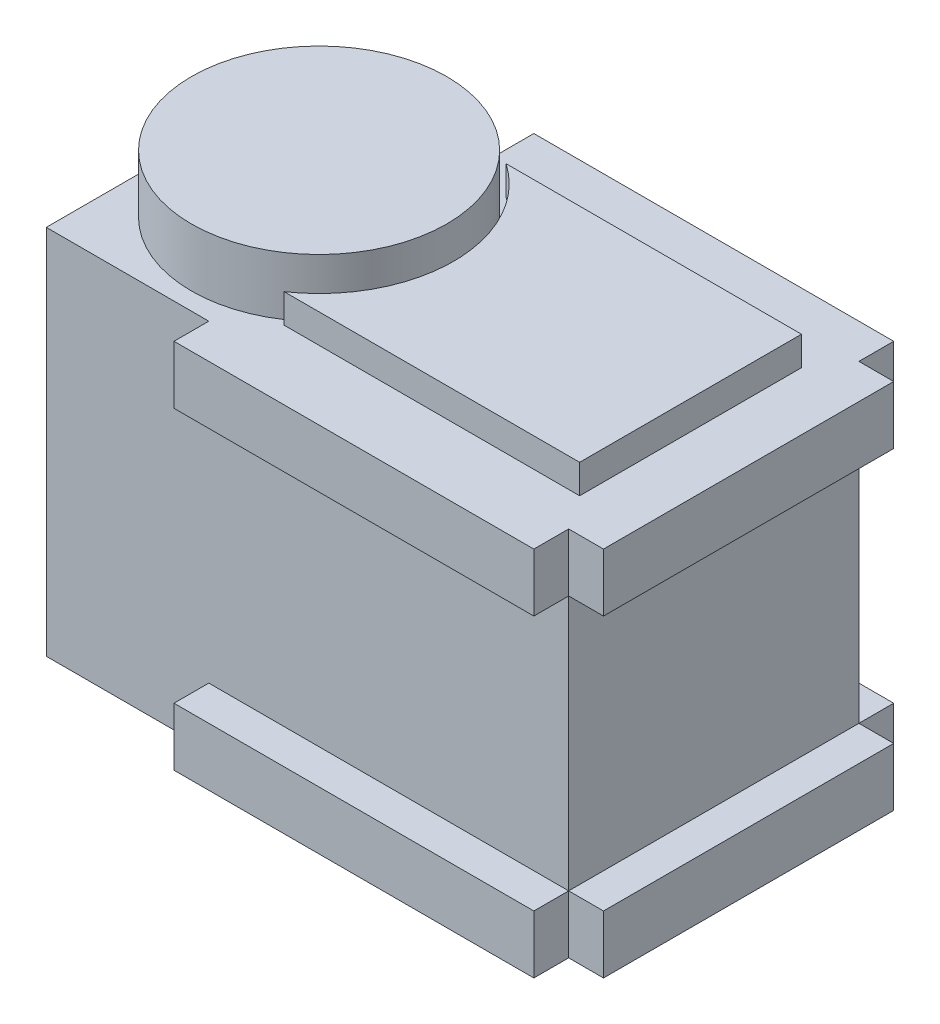
ISO-10303-21;
HEADER;
FILE_DESCRIPTION(('STEP AP214'),'2;1');
FILE_NAME('part.step','',(''),(''),'','','');
FILE_SCHEMA(('AUTOMOTIVE_DESIGN { 1 0 10303 214 1 1 1 1 }'));
ENDSEC;
DATA;
#1=APPLICATION_CONTEXT('core data for automotive mechanical design processes');
#2=APPLICATION_PROTOCOL_DEFINITION('international standard','automotive_design',2000,#1);
#3=PRODUCT_CONTEXT('',#1,'mechanical');
#4=PRODUCT('Part','Part','',(#3));
#5=PRODUCT_RELATED_PRODUCT_CATEGORY('part','',(#4));
#6=PRODUCT_DEFINITION_FORMATION('','',#4);
#7=PRODUCT_DEFINITION_CONTEXT('part definition',#1,'design');
#8=PRODUCT_DEFINITION('design','',#6,#7);
#9=PRODUCT_DEFINITION_SHAPE('','',#8);
#10=(LENGTH_UNIT() NAMED_UNIT(*) SI_UNIT(.MILLI.,.METRE.));
#11=(NAMED_UNIT(*) PLANE_ANGLE_UNIT() SI_UNIT($,.RADIAN.));
#12=(NAMED_UNIT(*) SI_UNIT($,.STERADIAN.) SOLID_ANGLE_UNIT());
#13=UNCERTAINTY_MEASURE_WITH_UNIT(LENGTH_MEASURE(1.E-05),#10,'distance_accuracy_value','');
#14=(GEOMETRIC_REPRESENTATION_CONTEXT(3) GLOBAL_UNCERTAINTY_ASSIGNED_CONTEXT((#13)) GLOBAL_UNIT_ASSIGNED_CONTEXT((#10,
#11,#12)) REPRESENTATION_CONTEXT('',''));
#15=CARTESIAN_POINT('',(0.,0.,0.));
#16=DIRECTION('',(0.,0.,1.));
#17=DIRECTION('',(1.,0.,0.));
#18=AXIS2_PLACEMENT_3D('',#15,#16,#17);
#19=CARTESIAN_POINT('',(22.5,32.,12.5));
#20=DIRECTION('',(-1.,0.,0.));
#21=DIRECTION('',(0.,0.,1.));
#22=AXIS2_PLACEMENT_3D('',#19,#20,#21);
#23=PLANE('',#22);
#24=DIRECTION('',(0.,-1.,0.));
#25=VECTOR('',#24,1.);
#26=CARTESIAN_POINT('',(22.5,27.,12.5));
#27=LINE('',#26,#25);
#28=CARTESIAN_POINT('',(22.5,32.,12.5));
#29=VERTEX_POINT('',#28);
#30=CARTESIAN_POINT('',(22.5,27.,12.5));
#31=VERTEX_POINT('',#30);
#32=EDGE_CURVE('E242',#29,#31,#27,.T.);
#33=ORIENTED_EDGE('',*,*,#32,.F.);
#34=DIRECTION('',(0.,0.,-1.));
#35=VECTOR('',#34,1.);
#36=CARTESIAN_POINT('',(22.5,32.,12.5));
#37=LINE('',#36,#35);
#38=CARTESIAN_POINT('',(22.5,32.,15.5));
#39=VERTEX_POINT('',#38);
#40=EDGE_CURVE('E476',#39,#29,#37,.T.);
#41=ORIENTED_EDGE('',*,*,#40,.F.);
#42=DIRECTION('',(0.,1.,0.));
#43=VECTOR('',#42,1.);
#44=CARTESIAN_POINT('',(22.5,32.,15.5));
#45=LINE('',#44,#43);
#46=CARTESIAN_POINT('',(22.5,27.,15.5));
#47=VERTEX_POINT('',#46);
#48=EDGE_CURVE('E390',#47,#39,#45,.T.);
#49=ORIENTED_EDGE('',*,*,#48,.F.);
#50=DIRECTION('',(0.,0.,-1.));
#51=VECTOR('',#50,1.);
#52=CARTESIAN_POINT('',(22.5,27.,15.5));
#53=LINE('',#52,#51);
#54=EDGE_CURVE('E404',#47,#31,#53,.T.);
#55=ORIENTED_EDGE('',*,*,#54,.T.);
#56=EDGE_LOOP('',(#33,#41,#49,#55));
#57=FACE_BOUND('',#56,.T.);
#58=ADVANCED_FACE('F41',(#57),#23,.F.);
#59=DIRECTION('',(0.,0.,-1.));
#60=VECTOR('',#59,1.);
#61=CARTESIAN_POINT('',(22.5,27.,12.5));
#62=LINE('',#61,#60);
#63=CARTESIAN_POINT('',(22.5,27.,-12.5));
#64=VERTEX_POINT('',#63);
#65=EDGE_CURVE('E544',#31,#64,#62,.T.);
#66=ORIENTED_EDGE('',*,*,#65,.F.);
#67=DIRECTION('',(0.,-1.,0.));
#68=VECTOR('',#67,1.);
#69=CARTESIAN_POINT('',(22.5,32.,12.5));
#70=LINE('',#69,#68);
#71=CARTESIAN_POINT('',(22.5,5.,12.5));
#72=VERTEX_POINT('',#71);
#73=EDGE_CURVE('E492',#31,#72,#70,.T.);
#74=ORIENTED_EDGE('',*,*,#73,.T.);
#75=DIRECTION('',(0.,0.,1.));
#76=VECTOR('',#75,1.);
#77=CARTESIAN_POINT('',(22.5,5.,12.5));
#78=LINE('',#77,#76);
#79=CARTESIAN_POINT('',(22.5,5.,-12.5));
#80=VERTEX_POINT('',#79);
#81=EDGE_CURVE('E259',#80,#72,#78,.T.);
#82=ORIENTED_EDGE('',*,*,#81,.F.);
#83=DIRECTION('',(0.,-1.,0.));
#84=VECTOR('',#83,1.);
#85=CARTESIAN_POINT('',(22.5,32.,-12.5));
#86=LINE('',#85,#84);
#87=EDGE_CURVE('E11',#64,#80,#86,.T.);
#88=ORIENTED_EDGE('',*,*,#87,.F.);
#89=EDGE_LOOP('',(#66,#74,#82,#88));
#90=FACE_BOUND('',#89,.T.);
#91=ADVANCED_FACE('F542',(#90),#23,.F.);
#92=DIRECTION('',(0.,1.,0.));
#93=VECTOR('',#92,1.);
#94=CARTESIAN_POINT('',(22.5,27.,-12.5));
#95=LINE('',#94,#93);
#96=CARTESIAN_POINT('',(22.5,32.,-12.5));
#97=VERTEX_POINT('',#96);
#98=EDGE_CURVE('E238',#64,#97,#95,.T.);
#99=ORIENTED_EDGE('',*,*,#98,.F.);
#100=DIRECTION('',(0.,0.,1.));
#101=VECTOR('',#100,1.);
#102=CARTESIAN_POINT('',(22.5,27.,-15.5));
#103=LINE('',#102,#101);
#104=CARTESIAN_POINT('',(22.5,27.,-15.5));
#105=VERTEX_POINT('',#104);
#106=EDGE_CURVE('E351',#105,#64,#103,.T.);
#107=ORIENTED_EDGE('',*,*,#106,.F.);
#108=DIRECTION('',(0.,-1.,0.));
#109=VECTOR('',#108,1.);
#110=CARTESIAN_POINT('',(22.5,32.,-15.5));
#111=LINE('',#110,#109);
#112=CARTESIAN_POINT('',(22.5,32.,-15.5));
#113=VERTEX_POINT('',#112);
#114=EDGE_CURVE('E322',#113,#105,#111,.T.);
#115=ORIENTED_EDGE('',*,*,#114,.F.);
#116=EDGE_CURVE('E481',#97,#113,#37,.T.);
#117=ORIENTED_EDGE('',*,*,#116,.F.);
#118=EDGE_LOOP('',(#99,#107,#115,#117));
#119=FACE_BOUND('',#118,.T.);
#120=ADVANCED_FACE('F608',(#119),#23,.F.);
#121=DIRECTION('',(0.,-1.,0.));
#122=VECTOR('',#121,1.);
#123=CARTESIAN_POINT('',(22.5,5.,12.5));
#124=LINE('',#123,#122);
#125=CARTESIAN_POINT('',(22.5,0.,12.5));
#126=VERTEX_POINT('',#125);
#127=EDGE_CURVE('E245',#72,#126,#124,.T.);
#128=ORIENTED_EDGE('',*,*,#127,.F.);
#129=DIRECTION('',(0.,0.,-1.));
#130=VECTOR('',#129,1.);
#131=CARTESIAN_POINT('',(22.5,5.,15.5));
#132=LINE('',#131,#130);
#133=CARTESIAN_POINT('',(22.5,5.,15.5));
#134=VERTEX_POINT('',#133);
#135=EDGE_CURVE('E385',#134,#72,#132,.T.);
#136=ORIENTED_EDGE('',*,*,#135,.F.);
#137=DIRECTION('',(0.,1.,0.));
#138=VECTOR('',#137,1.);
#139=CARTESIAN_POINT('',(22.5,0.,15.5));
#140=LINE('',#139,#138);
#141=CARTESIAN_POINT('',(22.5,0.,15.5));
#142=VERTEX_POINT('',#141);
#143=EDGE_CURVE('E356',#142,#134,#140,.T.);
#144=ORIENTED_EDGE('',*,*,#143,.F.);
#145=DIRECTION('',(0.,0.,-1.));
#146=VECTOR('',#145,1.);
#147=CARTESIAN_POINT('',(22.5,0.,12.5));
#148=LINE('',#147,#146);
#149=EDGE_CURVE('E493',#142,#126,#148,.T.);
#150=ORIENTED_EDGE('',*,*,#149,.T.);
#151=EDGE_LOOP('',(#128,#136,#144,#150));
#152=FACE_BOUND('',#151,.T.);
#153=ADVANCED_FACE('F43',(#152),#23,.F.);
#154=DIRECTION('',(0.,1.,0.));
#155=VECTOR('',#154,1.);
#156=CARTESIAN_POINT('',(22.5,5.,-12.5));
#157=LINE('',#156,#155);
#158=CARTESIAN_POINT('',(22.5,0.,-12.5));
#159=VERTEX_POINT('',#158);
#160=EDGE_CURVE('E65',#159,#80,#157,.T.);
#161=ORIENTED_EDGE('',*,*,#160,.F.);
#162=CARTESIAN_POINT('',(22.5,0.,-15.5));
#163=VERTEX_POINT('',#162);
#164=EDGE_CURVE('E472',#159,#163,#148,.T.);
#165=ORIENTED_EDGE('',*,*,#164,.T.);
#166=DIRECTION('',(0.,-1.,0.));
#167=VECTOR('',#166,1.);
#168=CARTESIAN_POINT('',(22.5,0.,-15.5));
#169=LINE('',#168,#167);
#170=CARTESIAN_POINT('',(22.5,5.,-15.5));
#171=VERTEX_POINT('',#170);
#172=EDGE_CURVE('E290',#171,#163,#169,.T.);
#173=ORIENTED_EDGE('',*,*,#172,.F.);
#174=DIRECTION('',(0.,0.,1.));
#175=VECTOR('',#174,1.);
#176=CARTESIAN_POINT('',(22.5,5.,-15.5));
#177=LINE('',#176,#175);
#178=EDGE_CURVE('E304',#171,#80,#177,.T.);
#179=ORIENTED_EDGE('',*,*,#178,.T.);
#180=EDGE_LOOP('',(#161,#165,#173,#179));
#181=FACE_BOUND('',#180,.T.);
#182=ADVANCED_FACE('F583',(#181),#23,.F.);
#183=CARTESIAN_POINT('',(-22.5,32.,-12.5));
#184=DIRECTION('',(0.,0.,1.));
#185=DIRECTION('',(1.,0.,0.));
#186=AXIS2_PLACEMENT_3D('',#183,#184,#185);
#187=PLANE('',#186);
#188=DIRECTION('',(0.,1.,0.));
#189=VECTOR('',#188,1.);
#190=CARTESIAN_POINT('',(-8.5,0.,-12.5));
#191=LINE('',#190,#189);
#192=CARTESIAN_POINT('',(-8.5,0.,-12.5));
#193=VERTEX_POINT('',#192);
#194=CARTESIAN_POINT('',(-8.5,5.,-12.5));
#195=VERTEX_POINT('',#194);
#196=EDGE_CURVE('E289',#193,#195,#191,.T.);
#197=ORIENTED_EDGE('',*,*,#196,.F.);
#198=DIRECTION('',(-1.,0.,0.));
#199=VECTOR('',#198,1.);
#200=CARTESIAN_POINT('',(-22.5,0.,-12.5));
#201=LINE('',#200,#199);
#202=CARTESIAN_POINT('',(-22.5,0.,-12.5));
#203=VERTEX_POINT('',#202);
#204=EDGE_CURVE('E496',#193,#203,#201,.T.);
#205=ORIENTED_EDGE('',*,*,#204,.T.);
#206=DIRECTION('',(0.,-1.,0.));
#207=VECTOR('',#206,1.);
#208=CARTESIAN_POINT('',(-22.5,32.,-12.5));
#209=LINE('',#208,#207);
#210=CARTESIAN_POINT('',(-22.5,32.,-12.5));
#211=VERTEX_POINT('',#210);
#212=EDGE_CURVE('E50',#211,#203,#209,.T.);
#213=ORIENTED_EDGE('',*,*,#212,.F.);
#214=DIRECTION('',(-1.,0.,0.));
#215=VECTOR('',#214,1.);
#216=CARTESIAN_POINT('',(-22.5,32.,-12.5));
#217=LINE('',#216,#215);
#218=CARTESIAN_POINT('',(-8.5,32.,-12.5));
#219=VERTEX_POINT('',#218);
#220=EDGE_CURVE('E480',#219,#211,#217,.T.);
#221=ORIENTED_EDGE('',*,*,#220,.F.);
#222=DIRECTION('',(0.,1.,0.));
#223=VECTOR('',#222,1.);
#224=CARTESIAN_POINT('',(-8.5,32.,-12.5));
#225=LINE('',#224,#223);
#226=CARTESIAN_POINT('',(-8.5,27.,-12.5));
#227=VERTEX_POINT('',#226);
#228=EDGE_CURVE('E327',#227,#219,#225,.T.);
#229=ORIENTED_EDGE('',*,*,#228,.F.);
#230=DIRECTION('',(-1.,0.,0.));
#231=VECTOR('',#230,1.);
#232=CARTESIAN_POINT('',(-8.5,27.,-12.5));
#233=LINE('',#232,#231);
#234=EDGE_CURVE('E321',#64,#227,#233,.T.);
#235=ORIENTED_EDGE('',*,*,#234,.F.);
#236=ORIENTED_EDGE('',*,*,#87,.T.);
#237=DIRECTION('',(1.,0.,0.));
#238=VECTOR('',#237,1.);
#239=CARTESIAN_POINT('',(22.5,5.,-12.5));
#240=LINE('',#239,#238);
#241=EDGE_CURVE('E295',#195,#80,#240,.T.);
#242=ORIENTED_EDGE('',*,*,#241,.F.);
#243=EDGE_LOOP('',(#197,#205,#213,#221,#229,#235,#236,#242));
#244=FACE_BOUND('',#243,.T.);
#245=ADVANCED_FACE('F594',(#244),#187,.F.);
#246=CARTESIAN_POINT('',(-22.5,32.,12.5));
#247=DIRECTION('',(0.,0.,-1.));
#248=DIRECTION('',(-1.,0.,0.));
#249=AXIS2_PLACEMENT_3D('',#246,#247,#248);
#250=PLANE('',#249);
#251=DIRECTION('',(-1.,0.,0.));
#252=VECTOR('',#251,1.);
#253=CARTESIAN_POINT('',(22.5,5.,12.5));
#254=LINE('',#253,#252);
#255=CARTESIAN_POINT('',(-8.5,4.99999999999999,12.5));
#256=VERTEX_POINT('',#255);
#257=EDGE_CURVE('E355',#72,#256,#254,.T.);
#258=ORIENTED_EDGE('',*,*,#257,.F.);
#259=ORIENTED_EDGE('',*,*,#73,.F.);
#260=DIRECTION('',(1.,0.,0.));
#261=VECTOR('',#260,1.);
#262=CARTESIAN_POINT('',(22.5,27.,12.5));
#263=LINE('',#262,#261);
#264=CARTESIAN_POINT('',(-8.5,27.,12.5));
#265=VERTEX_POINT('',#264);
#266=EDGE_CURVE('E395',#265,#31,#263,.T.);
#267=ORIENTED_EDGE('',*,*,#266,.F.);
#268=DIRECTION('',(0.,-1.,0.));
#269=VECTOR('',#268,1.);
#270=CARTESIAN_POINT('',(-8.5,32.,12.5));
#271=LINE('',#270,#269);
#272=CARTESIAN_POINT('',(-8.5,32.,12.5));
#273=VERTEX_POINT('',#272);
#274=EDGE_CURVE('E389',#273,#265,#271,.T.);
#275=ORIENTED_EDGE('',*,*,#274,.F.);
#276=DIRECTION('',(1.,0.,0.));
#277=VECTOR('',#276,1.);
#278=CARTESIAN_POINT('',(-22.5,32.,12.5));
#279=LINE('',#278,#277);
#280=CARTESIAN_POINT('',(-22.5,32.,12.5));
#281=VERTEX_POINT('',#280);
#282=EDGE_CURVE('E488',#281,#273,#279,.T.);
#283=ORIENTED_EDGE('',*,*,#282,.F.);
#284=DIRECTION('',(0.,-1.,0.));
#285=VECTOR('',#284,1.);
#286=CARTESIAN_POINT('',(-22.5,32.,12.5));
#287=LINE('',#286,#285);
#288=CARTESIAN_POINT('',(-22.5,0.,12.5));
#289=VERTEX_POINT('',#288);
#290=EDGE_CURVE('E508',#281,#289,#287,.T.);
#291=ORIENTED_EDGE('',*,*,#290,.T.);
#292=DIRECTION('',(1.,0.,0.));
#293=VECTOR('',#292,1.);
#294=CARTESIAN_POINT('',(-22.5,0.,12.5));
#295=LINE('',#294,#293);
#296=CARTESIAN_POINT('',(-8.5,0.,12.5));
#297=VERTEX_POINT('',#296);
#298=EDGE_CURVE('E502',#289,#297,#295,.T.);
#299=ORIENTED_EDGE('',*,*,#298,.T.);
#300=DIRECTION('',(0.,-1.,0.));
#301=VECTOR('',#300,1.);
#302=CARTESIAN_POINT('',(-8.5,0.,12.5));
#303=LINE('',#302,#301);
#304=EDGE_CURVE('E361',#256,#297,#303,.T.);
#305=ORIENTED_EDGE('',*,*,#304,.F.);
#306=EDGE_LOOP('',(#258,#259,#267,#275,#283,#291,#299,#305));
#307=FACE_BOUND('',#306,.T.);
#308=ADVANCED_FACE('F530',(#307),#250,.F.);
#309=CARTESIAN_POINT('',(0.,32.,0.));
#310=DIRECTION('',(0.,-1.,0.));
#311=DIRECTION('',(0.,0.,-1.));
#312=AXIS2_PLACEMENT_3D('',#309,#310,#311);
#313=PLANE('',#312);
#314=DIRECTION('',(0.,0.,1.));
#315=VECTOR('',#314,1.);
#316=CARTESIAN_POINT('',(-22.5,32.,12.5));
#317=LINE('',#316,#315);
#318=CARTESIAN_POINT('',(-22.5,32.,0.));
#319=VERTEX_POINT('',#318);
#320=EDGE_CURVE('E485',#211,#319,#317,.T.);
#321=ORIENTED_EDGE('',*,*,#320,.T.);
#322=CARTESIAN_POINT('',(-11.5,32.,0.));
#323=DIRECTION('',(0.,1.,0.));
#324=DIRECTION('',(0.,0.,1.));
#325=AXIS2_PLACEMENT_3D('',#322,#323,#324);
#326=CIRCLE('',#325,11.);
#327=EDGE_CURVE('E467',#319,#319,#326,.T.);
#328=ORIENTED_EDGE('',*,*,#327,.F.);
#329=EDGE_CURVE('E484',#319,#281,#317,.T.);
#330=ORIENTED_EDGE('',*,*,#329,.T.);
#331=ORIENTED_EDGE('',*,*,#282,.T.);
#332=DIRECTION('',(0.,0.,-1.));
#333=VECTOR('',#332,1.);
#334=CARTESIAN_POINT('',(-8.5,32.,15.5));
#335=LINE('',#334,#333);
#336=CARTESIAN_POINT('',(-8.5,32.,15.5));
#337=VERTEX_POINT('',#336);
#338=EDGE_CURVE('E418',#337,#273,#335,.T.);
#339=ORIENTED_EDGE('',*,*,#338,.F.);
#340=DIRECTION('',(-1.,0.,0.));
#341=VECTOR('',#340,1.);
#342=CARTESIAN_POINT('',(22.5,32.,15.5));
#343=LINE('',#342,#341);
#344=EDGE_CURVE('E394',#39,#337,#343,.T.);
#345=ORIENTED_EDGE('',*,*,#344,.F.);
#346=ORIENTED_EDGE('',*,*,#40,.T.);
#347=DIRECTION('',(-1.,0.,0.));
#348=VECTOR('',#347,1.);
#349=CARTESIAN_POINT('',(25.5,32.,12.5));
#350=LINE('',#349,#348);
#351=CARTESIAN_POINT('',(25.5,32.,12.5));
#352=VERTEX_POINT('',#351);
#353=EDGE_CURVE('E553',#352,#29,#350,.T.);
#354=ORIENTED_EDGE('',*,*,#353,.F.);
#355=DIRECTION('',(0.,0.,1.));
#356=VECTOR('',#355,1.);
#357=CARTESIAN_POINT('',(25.5,32.,12.5));
#358=LINE('',#357,#356);
#359=CARTESIAN_POINT('',(25.5,32.,-12.5));
#360=VERTEX_POINT('',#359);
#361=EDGE_CURVE('E234',#360,#352,#358,.T.);
#362=ORIENTED_EDGE('',*,*,#361,.F.);
#363=DIRECTION('',(-1.,0.,0.));
#364=VECTOR('',#363,1.);
#365=CARTESIAN_POINT('',(25.5,32.,-12.5));
#366=LINE('',#365,#364);
#367=EDGE_CURVE('E57',#360,#97,#366,.T.);
#368=ORIENTED_EDGE('',*,*,#367,.T.);
#369=ORIENTED_EDGE('',*,*,#116,.T.);
#370=DIRECTION('',(1.,0.,0.));
#371=VECTOR('',#370,1.);
#372=CARTESIAN_POINT('',(22.5,32.,-15.5));
#373=LINE('',#372,#371);
#374=CARTESIAN_POINT('',(-8.5,32.,-15.5));
#375=VERTEX_POINT('',#374);
#376=EDGE_CURVE('E333',#375,#113,#373,.T.);
#377=ORIENTED_EDGE('',*,*,#376,.F.);
#378=DIRECTION('',(0.,0.,1.));
#379=VECTOR('',#378,1.);
#380=CARTESIAN_POINT('',(-8.5,32.,-15.5));
#381=LINE('',#380,#379);
#382=EDGE_CURVE('E337',#375,#219,#381,.T.);
#383=ORIENTED_EDGE('',*,*,#382,.T.);
#384=ORIENTED_EDGE('',*,*,#220,.T.);
#385=EDGE_LOOP('',(#321,#328,#330,#331,#339,#345,#346,#354,#362,#368,#369,#377,#383,#384));
#386=FACE_BOUND('',#385,.T.);
#387=CARTESIAN_POINT('',(-11.5,32.,0.));
#388=DIRECTION('',(0.,-1.,0.));
#389=DIRECTION('',(0.,0.,1.));
#390=AXIS2_PLACEMENT_3D('',#387,#388,#389);
#391=CIRCLE('',#390,11.5830578994326);
#392=CARTESIAN_POINT('',(-4.95274794409742,32.,-9.55514106740913));
#393=VERTEX_POINT('',#392);
#394=CARTESIAN_POINT('',(-4.95274794409742,32.,9.55514106740913));
#395=VERTEX_POINT('',#394);
#396=EDGE_CURVE('E422',#393,#395,#391,.T.);
#397=ORIENTED_EDGE('',*,*,#396,.F.);
#398=DIRECTION('',(-1.,0.,0.));
#399=VECTOR('',#398,1.);
#400=CARTESIAN_POINT('',(-4.95274794409742,32.,-9.55514106740913));
#401=LINE('',#400,#399);
#402=CARTESIAN_POINT('',(20.5,32.,-9.55514106740913));
#403=VERTEX_POINT('',#402);
#404=EDGE_CURVE('E428',#403,#393,#401,.T.);
#405=ORIENTED_EDGE('',*,*,#404,.F.);
#406=DIRECTION('',(0.,0.,-1.));
#407=VECTOR('',#406,1.);
#408=CARTESIAN_POINT('',(20.5,32.,-9.55514106740913));
#409=LINE('',#408,#407);
#410=CARTESIAN_POINT('',(20.5,32.,9.55514106740913));
#411=VERTEX_POINT('',#410);
#412=EDGE_CURVE('E445',#411,#403,#409,.T.);
#413=ORIENTED_EDGE('',*,*,#412,.F.);
#414=DIRECTION('',(1.,0.,0.));
#415=VECTOR('',#414,1.);
#416=CARTESIAN_POINT('',(-4.95274794409742,32.,9.55514106740913));
#417=LINE('',#416,#415);
#418=EDGE_CURVE('E441',#395,#411,#417,.T.);
#419=ORIENTED_EDGE('',*,*,#418,.F.);
#420=EDGE_LOOP('',(#397,#405,#413,#419));
#421=FACE_BOUND('',#420,.T.);
#422=ADVANCED_FACE('F563',(#386,#421),#313,.F.);
#423=CARTESIAN_POINT('',(-22.5,32.,12.5));
#424=DIRECTION('',(1.,0.,0.));
#425=DIRECTION('',(0.,0.,-1.));
#426=AXIS2_PLACEMENT_3D('',#423,#424,#425);
#427=PLANE('',#426);
#428=DIRECTION('',(0.,0.,1.));
#429=VECTOR('',#428,1.);
#430=CARTESIAN_POINT('',(-22.5,0.,12.5));
#431=LINE('',#430,#429);
#432=EDGE_CURVE('E499',#203,#289,#431,.T.);
#433=ORIENTED_EDGE('',*,*,#432,.T.);
#434=ORIENTED_EDGE('',*,*,#290,.F.);
#435=ORIENTED_EDGE('',*,*,#329,.F.);
#436=ORIENTED_EDGE('',*,*,#320,.F.);
#437=ORIENTED_EDGE('',*,*,#212,.T.);
#438=EDGE_LOOP('',(#433,#434,#435,#436,#437));
#439=FACE_BOUND('',#438,.T.);
#440=ADVANCED_FACE('F517',(#439),#427,.F.);
#441=CARTESIAN_POINT('',(0.,0.,0.));
#442=DIRECTION('',(0.,-1.,0.));
#443=DIRECTION('',(0.,0.,-1.));
#444=AXIS2_PLACEMENT_3D('',#441,#442,#443);
#445=PLANE('',#444);
#446=ORIENTED_EDGE('',*,*,#149,.F.);
#447=DIRECTION('',(1.,0.,0.));
#448=VECTOR('',#447,1.);
#449=CARTESIAN_POINT('',(22.5,0.,15.5));
#450=LINE('',#449,#448);
#451=CARTESIAN_POINT('',(-8.5,0.,15.5));
#452=VERTEX_POINT('',#451);
#453=EDGE_CURVE('E367',#452,#142,#450,.T.);
#454=ORIENTED_EDGE('',*,*,#453,.F.);
#455=DIRECTION('',(0.,0.,-1.));
#456=VECTOR('',#455,1.);
#457=CARTESIAN_POINT('',(-8.5,0.,15.5));
#458=LINE('',#457,#456);
#459=EDGE_CURVE('E371',#452,#297,#458,.T.);
#460=ORIENTED_EDGE('',*,*,#459,.T.);
#461=ORIENTED_EDGE('',*,*,#298,.F.);
#462=ORIENTED_EDGE('',*,*,#432,.F.);
#463=ORIENTED_EDGE('',*,*,#204,.F.);
#464=DIRECTION('',(0.,0.,1.));
#465=VECTOR('',#464,1.);
#466=CARTESIAN_POINT('',(-8.5,0.,-15.5));
#467=LINE('',#466,#465);
#468=CARTESIAN_POINT('',(-8.5,0.,-15.5));
#469=VERTEX_POINT('',#468);
#470=EDGE_CURVE('E317',#469,#193,#467,.T.);
#471=ORIENTED_EDGE('',*,*,#470,.F.);
#472=DIRECTION('',(-1.,0.,0.));
#473=VECTOR('',#472,1.);
#474=CARTESIAN_POINT('',(22.5,0.,-15.5));
#475=LINE('',#474,#473);
#476=EDGE_CURVE('E294',#163,#469,#475,.T.);
#477=ORIENTED_EDGE('',*,*,#476,.F.);
#478=ORIENTED_EDGE('',*,*,#164,.F.);
#479=DIRECTION('',(-1.,0.,0.));
#480=VECTOR('',#479,1.);
#481=CARTESIAN_POINT('',(25.5,0.,-12.5));
#482=LINE('',#481,#480);
#483=CARTESIAN_POINT('',(25.5,0.,-12.5));
#484=VERTEX_POINT('',#483);
#485=EDGE_CURVE('E281',#484,#159,#482,.T.);
#486=ORIENTED_EDGE('',*,*,#485,.F.);
#487=DIRECTION('',(0.,0.,-1.));
#488=VECTOR('',#487,1.);
#489=CARTESIAN_POINT('',(25.5,0.,12.5));
#490=LINE('',#489,#488);
#491=CARTESIAN_POINT('',(25.5,0.,12.5));
#492=VERTEX_POINT('',#491);
#493=EDGE_CURVE('E258',#492,#484,#490,.T.);
#494=ORIENTED_EDGE('',*,*,#493,.F.);
#495=DIRECTION('',(-1.,0.,0.));
#496=VECTOR('',#495,1.);
#497=CARTESIAN_POINT('',(25.5,0.,12.5));
#498=LINE('',#497,#496);
#499=EDGE_CURVE('E285',#492,#126,#498,.T.);
#500=ORIENTED_EDGE('',*,*,#499,.T.);
#501=EDGE_LOOP('',(#446,#454,#460,#461,#462,#463,#471,#477,#478,#486,#494,#500));
#502=FACE_BOUND('',#501,.T.);
#503=ADVANCED_FACE('F523',(#502),#445,.T.);
#504=CARTESIAN_POINT('',(-11.5,37.,0.));
#505=DIRECTION('',(0.,-1.,0.));
#506=DIRECTION('',(0.,0.,-1.));
#507=AXIS2_PLACEMENT_3D('',#504,#505,#506);
#508=CYLINDRICAL_SURFACE('',#507,11.);
#509=CARTESIAN_POINT('',(-11.5,37.,0.));
#510=DIRECTION('',(0.,1.,0.));
#511=DIRECTION('',(0.,0.,1.));
#512=AXIS2_PLACEMENT_3D('',#509,#510,#511);
#513=CIRCLE('',#512,11.);
#514=CARTESIAN_POINT('',(-11.5,37.,11.));
#515=VERTEX_POINT('',#514);
#516=EDGE_CURVE('E468',#515,#515,#513,.T.);
#517=ORIENTED_EDGE('',*,*,#516,.F.);
#518=EDGE_LOOP('',(#517));
#519=FACE_BOUND('',#518,.T.);
#520=ORIENTED_EDGE('',*,*,#327,.T.);
#521=EDGE_LOOP('',(#520));
#522=FACE_BOUND('',#521,.T.);
#523=ADVANCED_FACE('F685',(#519,#522),#508,.T.);
#524=CARTESIAN_POINT('',(-11.5,37.,0.));
#525=DIRECTION('',(0.,1.,0.));
#526=DIRECTION('',(0.,0.,1.));
#527=AXIS2_PLACEMENT_3D('',#524,#525,#526);
#528=PLANE('',#527);
#529=ORIENTED_EDGE('',*,*,#516,.T.);
#530=EDGE_LOOP('',(#529));
#531=FACE_BOUND('',#530,.T.);
#532=ADVANCED_FACE('F835',(#531),#528,.T.);
#533=CARTESIAN_POINT('',(-11.5,34.5,0.));
#534=DIRECTION('',(0.,-1.,0.));
#535=DIRECTION('',(0.,0.,-1.));
#536=AXIS2_PLACEMENT_3D('',#533,#534,#535);
#537=CYLINDRICAL_SURFACE('',#536,11.5830578994326);
#538=ORIENTED_EDGE('',*,*,#396,.T.);
#539=DIRECTION('',(0.,-1.,0.));
#540=VECTOR('',#539,1.);
#541=CARTESIAN_POINT('',(-4.95274794409742,34.5,9.55514106740913));
#542=LINE('',#541,#540);
#543=CARTESIAN_POINT('',(-4.95274794409742,34.5,9.55514106740913));
#544=VERTEX_POINT('',#543);
#545=EDGE_CURVE('E463',#544,#395,#542,.T.);
#546=ORIENTED_EDGE('',*,*,#545,.F.);
#547=CARTESIAN_POINT('',(-11.5,34.5,0.));
#548=DIRECTION('',(0.,-1.,0.));
#549=DIRECTION('',(0.,0.,1.));
#550=AXIS2_PLACEMENT_3D('',#547,#548,#549);
#551=CIRCLE('',#550,11.5830578994326);
#552=CARTESIAN_POINT('',(-4.95274794409742,34.5,-9.55514106740913));
#553=VERTEX_POINT('',#552);
#554=EDGE_CURVE('E423',#553,#544,#551,.T.);
#555=ORIENTED_EDGE('',*,*,#554,.F.);
#556=DIRECTION('',(0.,-1.,0.));
#557=VECTOR('',#556,1.);
#558=CARTESIAN_POINT('',(-4.95274794409742,34.5,-9.55514106740913));
#559=LINE('',#558,#557);
#560=EDGE_CURVE('E437',#553,#393,#559,.T.);
#561=ORIENTED_EDGE('',*,*,#560,.T.);
#562=EDGE_LOOP('',(#538,#546,#555,#561));
#563=FACE_BOUND('',#562,.T.);
#564=ADVANCED_FACE('F831',(#563),#537,.F.);
#565=CARTESIAN_POINT('',(-4.95274794409742,34.5,9.55514106740913));
#566=DIRECTION('',(0.,0.,-1.));
#567=DIRECTION('',(-1.,0.,0.));
#568=AXIS2_PLACEMENT_3D('',#565,#566,#567);
#569=PLANE('',#568);
#570=ORIENTED_EDGE('',*,*,#418,.T.);
#571=DIRECTION('',(0.,-1.,0.));
#572=VECTOR('',#571,1.);
#573=CARTESIAN_POINT('',(20.5,34.5,9.55514106740913));
#574=LINE('',#573,#572);
#575=CARTESIAN_POINT('',(20.5,34.5,9.55514106740913));
#576=VERTEX_POINT('',#575);
#577=EDGE_CURVE('E459',#576,#411,#574,.T.);
#578=ORIENTED_EDGE('',*,*,#577,.F.);
#579=DIRECTION('',(1.,0.,0.));
#580=VECTOR('',#579,1.);
#581=CARTESIAN_POINT('',(-4.95274794409742,34.5,9.55514106740913));
#582=LINE('',#581,#580);
#583=EDGE_CURVE('E427',#544,#576,#582,.T.);
#584=ORIENTED_EDGE('',*,*,#583,.F.);
#585=ORIENTED_EDGE('',*,*,#545,.T.);
#586=EDGE_LOOP('',(#570,#578,#584,#585));
#587=FACE_BOUND('',#586,.T.);
#588=ADVANCED_FACE('F827',(#587),#569,.F.);
#589=CARTESIAN_POINT('',(20.5,34.5,-9.55514106740913));
#590=DIRECTION('',(-1.,0.,0.));
#591=DIRECTION('',(0.,0.,1.));
#592=AXIS2_PLACEMENT_3D('',#589,#590,#591);
#593=PLANE('',#592);
#594=ORIENTED_EDGE('',*,*,#412,.T.);
#595=DIRECTION('',(0.,-1.,0.));
#596=VECTOR('',#595,1.);
#597=CARTESIAN_POINT('',(20.5,34.5,-9.55514106740913));
#598=LINE('',#597,#596);
#599=CARTESIAN_POINT('',(20.5,34.5,-9.55514106740913));
#600=VERTEX_POINT('',#599);
#601=EDGE_CURVE('E455',#600,#403,#598,.T.);
#602=ORIENTED_EDGE('',*,*,#601,.F.);
#603=DIRECTION('',(0.,0.,-1.));
#604=VECTOR('',#603,1.);
#605=CARTESIAN_POINT('',(20.5,34.5,-9.55514106740913));
#606=LINE('',#605,#604);
#607=EDGE_CURVE('E431',#576,#600,#606,.T.);
#608=ORIENTED_EDGE('',*,*,#607,.F.);
#609=ORIENTED_EDGE('',*,*,#577,.T.);
#610=EDGE_LOOP('',(#594,#602,#608,#609));
#611=FACE_BOUND('',#610,.T.);
#612=ADVANCED_FACE('F823',(#611),#593,.F.);
#613=CARTESIAN_POINT('',(-4.95274794409742,34.5,-9.55514106740913));
#614=DIRECTION('',(0.,0.,1.));
#615=DIRECTION('',(1.,0.,0.));
#616=AXIS2_PLACEMENT_3D('',#613,#614,#615);
#617=PLANE('',#616);
#618=ORIENTED_EDGE('',*,*,#404,.T.);
#619=ORIENTED_EDGE('',*,*,#560,.F.);
#620=DIRECTION('',(-1.,0.,0.));
#621=VECTOR('',#620,1.);
#622=CARTESIAN_POINT('',(-4.95274794409742,34.5,-9.55514106740913));
#623=LINE('',#622,#621);
#624=EDGE_CURVE('E434',#600,#553,#623,.T.);
#625=ORIENTED_EDGE('',*,*,#624,.F.);
#626=ORIENTED_EDGE('',*,*,#601,.T.);
#627=EDGE_LOOP('',(#618,#619,#625,#626));
#628=FACE_BOUND('',#627,.T.);
#629=ADVANCED_FACE('F819',(#628),#617,.F.);
#630=CARTESIAN_POINT('',(-11.5,34.5,0.));
#631=DIRECTION('',(0.,1.,0.));
#632=DIRECTION('',(0.,0.,1.));
#633=AXIS2_PLACEMENT_3D('',#630,#631,#632);
#634=PLANE('',#633);
#635=ORIENTED_EDGE('',*,*,#554,.T.);
#636=ORIENTED_EDGE('',*,*,#583,.T.);
#637=ORIENTED_EDGE('',*,*,#607,.T.);
#638=ORIENTED_EDGE('',*,*,#624,.T.);
#639=EDGE_LOOP('',(#635,#636,#637,#638));
#640=FACE_BOUND('',#639,.T.);
#641=ADVANCED_FACE('F816',(#640),#634,.T.);
#642=CARTESIAN_POINT('',(-8.5,32.,15.5));
#643=DIRECTION('',(1.,0.,0.));
#644=DIRECTION('',(0.,0.,-1.));
#645=AXIS2_PLACEMENT_3D('',#642,#643,#644);
#646=PLANE('',#645);
#647=ORIENTED_EDGE('',*,*,#274,.T.);
#648=DIRECTION('',(0.,0.,-1.));
#649=VECTOR('',#648,1.);
#650=CARTESIAN_POINT('',(-8.5,27.,15.5));
#651=LINE('',#650,#649);
#652=CARTESIAN_POINT('',(-8.5,27.,15.5));
#653=VERTEX_POINT('',#652);
#654=EDGE_CURVE('E414',#653,#265,#651,.T.);
#655=ORIENTED_EDGE('',*,*,#654,.F.);
#656=DIRECTION('',(0.,-1.,0.));
#657=VECTOR('',#656,1.);
#658=CARTESIAN_POINT('',(-8.5,32.,15.5));
#659=LINE('',#658,#657);
#660=EDGE_CURVE('E398',#337,#653,#659,.T.);
#661=ORIENTED_EDGE('',*,*,#660,.F.);
#662=ORIENTED_EDGE('',*,*,#338,.T.);
#663=EDGE_LOOP('',(#647,#655,#661,#662));
#664=FACE_BOUND('',#663,.T.);
#665=ADVANCED_FACE('F574',(#664),#646,.F.);
#666=CARTESIAN_POINT('',(22.5,27.,15.5));
#667=DIRECTION('',(0.,1.,0.));
#668=DIRECTION('',(-1.,0.,0.));
#669=AXIS2_PLACEMENT_3D('',#666,#667,#668);
#670=PLANE('',#669);
#671=ORIENTED_EDGE('',*,*,#266,.T.);
#672=ORIENTED_EDGE('',*,*,#54,.F.);
#673=DIRECTION('',(1.,0.,0.));
#674=VECTOR('',#673,1.);
#675=CARTESIAN_POINT('',(22.5,27.,15.5));
#676=LINE('',#675,#674);
#677=EDGE_CURVE('E401',#653,#47,#676,.T.);
#678=ORIENTED_EDGE('',*,*,#677,.F.);
#679=ORIENTED_EDGE('',*,*,#654,.T.);
#680=EDGE_LOOP('',(#671,#672,#678,#679));
#681=FACE_BOUND('',#680,.T.);
#682=ADVANCED_FACE('F571',(#681),#670,.F.);
#683=CARTESIAN_POINT('',(0.,0.,15.5));
#684=DIRECTION('',(0.,0.,-1.));
#685=DIRECTION('',(-1.,0.,0.));
#686=AXIS2_PLACEMENT_3D('',#683,#684,#685);
#687=PLANE('',#686);
#688=ORIENTED_EDGE('',*,*,#48,.T.);
#689=ORIENTED_EDGE('',*,*,#344,.T.);
#690=ORIENTED_EDGE('',*,*,#660,.T.);
#691=ORIENTED_EDGE('',*,*,#677,.T.);
#692=EDGE_LOOP('',(#688,#689,#690,#691));
#693=FACE_BOUND('',#692,.T.);
#694=ADVANCED_FACE('F697',(#693),#687,.F.);
#695=CARTESIAN_POINT('',(22.5,5.,15.5));
#696=DIRECTION('',(0.,-1.,0.));
#697=DIRECTION('',(1.,0.,0.));
#698=AXIS2_PLACEMENT_3D('',#695,#696,#697);
#699=PLANE('',#698);
#700=ORIENTED_EDGE('',*,*,#257,.T.);
#701=DIRECTION('',(0.,0.,-1.));
#702=VECTOR('',#701,1.);
#703=CARTESIAN_POINT('',(-8.5,5.,15.5));
#704=LINE('',#703,#702);
#705=CARTESIAN_POINT('',(-8.5,5.,15.5));
#706=VERTEX_POINT('',#705);
#707=EDGE_CURVE('E381',#706,#256,#704,.T.);
#708=ORIENTED_EDGE('',*,*,#707,.F.);
#709=DIRECTION('',(-1.,0.,0.));
#710=VECTOR('',#709,1.);
#711=CARTESIAN_POINT('',(22.5,5.,15.5));
#712=LINE('',#711,#710);
#713=EDGE_CURVE('E360',#134,#706,#712,.T.);
#714=ORIENTED_EDGE('',*,*,#713,.F.);
#715=ORIENTED_EDGE('',*,*,#135,.T.);
#716=EDGE_LOOP('',(#700,#708,#714,#715));
#717=FACE_BOUND('',#716,.T.);
#718=ADVANCED_FACE('F537',(#717),#699,.F.);
#719=CARTESIAN_POINT('',(-8.5,0.,15.5));
#720=DIRECTION('',(1.,0.,0.));
#721=DIRECTION('',(0.,0.,-1.));
#722=AXIS2_PLACEMENT_3D('',#719,#720,#721);
#723=PLANE('',#722);
#724=ORIENTED_EDGE('',*,*,#304,.T.);
#725=ORIENTED_EDGE('',*,*,#459,.F.);
#726=DIRECTION('',(0.,-1.,0.));
#727=VECTOR('',#726,1.);
#728=CARTESIAN_POINT('',(-8.5,0.,15.5));
#729=LINE('',#728,#727);
#730=EDGE_CURVE('E364',#706,#452,#729,.T.);
#731=ORIENTED_EDGE('',*,*,#730,.F.);
#732=ORIENTED_EDGE('',*,*,#707,.T.);
#733=EDGE_LOOP('',(#724,#725,#731,#732));
#734=FACE_BOUND('',#733,.T.);
#735=ADVANCED_FACE('F533',(#734),#723,.F.);
#736=CARTESIAN_POINT('',(0.,0.,15.5));
#737=DIRECTION('',(0.,0.,1.));
#738=DIRECTION('',(1.,0.,0.));
#739=AXIS2_PLACEMENT_3D('',#736,#737,#738);
#740=PLANE('',#739);
#741=ORIENTED_EDGE('',*,*,#143,.T.);
#742=ORIENTED_EDGE('',*,*,#713,.T.);
#743=ORIENTED_EDGE('',*,*,#730,.T.);
#744=ORIENTED_EDGE('',*,*,#453,.T.);
#745=EDGE_LOOP('',(#741,#742,#743,#744));
#746=FACE_BOUND('',#745,.T.);
#747=ADVANCED_FACE('F720',(#746),#740,.T.);
#748=CARTESIAN_POINT('',(-8.5,27.,-15.5));
#749=DIRECTION('',(0.,1.,0.));
#750=DIRECTION('',(-1.,0.,0.));
#751=AXIS2_PLACEMENT_3D('',#748,#749,#750);
#752=PLANE('',#751);
#753=ORIENTED_EDGE('',*,*,#234,.T.);
#754=DIRECTION('',(0.,0.,1.));
#755=VECTOR('',#754,1.);
#756=CARTESIAN_POINT('',(-8.5,27.,-15.5));
#757=LINE('',#756,#755);
#758=CARTESIAN_POINT('',(-8.5,27.,-15.5));
#759=VERTEX_POINT('',#758);
#760=EDGE_CURVE('E347',#759,#227,#757,.T.);
#761=ORIENTED_EDGE('',*,*,#760,.F.);
#762=DIRECTION('',(-1.,0.,0.));
#763=VECTOR('',#762,1.);
#764=CARTESIAN_POINT('',(-8.5,27.,-15.5));
#765=LINE('',#764,#763);
#766=EDGE_CURVE('E326',#105,#759,#765,.T.);
#767=ORIENTED_EDGE('',*,*,#766,.F.);
#768=ORIENTED_EDGE('',*,*,#106,.T.);
#769=EDGE_LOOP('',(#753,#761,#767,#768));
#770=FACE_BOUND('',#769,.T.);
#771=ADVANCED_FACE('F597',(#770),#752,.F.);
#772=CARTESIAN_POINT('',(-8.5,32.,-15.5));
#773=DIRECTION('',(1.,0.,0.));
#774=DIRECTION('',(0.,0.,-1.));
#775=AXIS2_PLACEMENT_3D('',#772,#773,#774);
#776=PLANE('',#775);
#777=ORIENTED_EDGE('',*,*,#228,.T.);
#778=ORIENTED_EDGE('',*,*,#382,.F.);
#779=DIRECTION('',(0.,1.,0.));
#780=VECTOR('',#779,1.);
#781=CARTESIAN_POINT('',(-8.5,32.,-15.5));
#782=LINE('',#781,#780);
#783=EDGE_CURVE('E330',#759,#375,#782,.T.);
#784=ORIENTED_EDGE('',*,*,#783,.F.);
#785=ORIENTED_EDGE('',*,*,#760,.T.);
#786=EDGE_LOOP('',(#777,#778,#784,#785));
#787=FACE_BOUND('',#786,.T.);
#788=ADVANCED_FACE('F601',(#787),#776,.F.);
#789=CARTESIAN_POINT('',(0.,0.,-15.5));
#790=DIRECTION('',(0.,0.,1.));
#791=DIRECTION('',(1.,0.,0.));
#792=AXIS2_PLACEMENT_3D('',#789,#790,#791);
#793=PLANE('',#792);
#794=ORIENTED_EDGE('',*,*,#114,.T.);
#795=ORIENTED_EDGE('',*,*,#766,.T.);
#796=ORIENTED_EDGE('',*,*,#783,.T.);
#797=ORIENTED_EDGE('',*,*,#376,.T.);
#798=EDGE_LOOP('',(#794,#795,#796,#797));
#799=FACE_BOUND('',#798,.T.);
#800=ADVANCED_FACE('F605',(#799),#793,.F.);
#801=CARTESIAN_POINT('',(-8.5,0.,-15.5));
#802=DIRECTION('',(1.,0.,0.));
#803=DIRECTION('',(0.,0.,-1.));
#804=AXIS2_PLACEMENT_3D('',#801,#802,#803);
#805=PLANE('',#804);
#806=ORIENTED_EDGE('',*,*,#196,.T.);
#807=DIRECTION('',(0.,0.,1.));
#808=VECTOR('',#807,1.);
#809=CARTESIAN_POINT('',(-8.5,5.,-15.5));
#810=LINE('',#809,#808);
#811=CARTESIAN_POINT('',(-8.5,5.,-15.5));
#812=VERTEX_POINT('',#811);
#813=EDGE_CURVE('E313',#812,#195,#810,.T.);
#814=ORIENTED_EDGE('',*,*,#813,.F.);
#815=DIRECTION('',(0.,1.,0.));
#816=VECTOR('',#815,1.);
#817=CARTESIAN_POINT('',(-8.5,0.,-15.5));
#818=LINE('',#817,#816);
#819=EDGE_CURVE('E298',#469,#812,#818,.T.);
#820=ORIENTED_EDGE('',*,*,#819,.F.);
#821=ORIENTED_EDGE('',*,*,#470,.T.);
#822=EDGE_LOOP('',(#806,#814,#820,#821));
#823=FACE_BOUND('',#822,.T.);
#824=ADVANCED_FACE('F803',(#823),#805,.F.);
#825=CARTESIAN_POINT('',(22.5,5.,-15.5));
#826=DIRECTION('',(0.,-1.,0.));
#827=DIRECTION('',(0.,0.,-1.));
#828=AXIS2_PLACEMENT_3D('',#825,#826,#827);
#829=PLANE('',#828);
#830=ORIENTED_EDGE('',*,*,#241,.T.);
#831=ORIENTED_EDGE('',*,*,#178,.F.);
#832=DIRECTION('',(1.,0.,0.));
#833=VECTOR('',#832,1.);
#834=CARTESIAN_POINT('',(22.5,5.,-15.5));
#835=LINE('',#834,#833);
#836=EDGE_CURVE('E301',#812,#171,#835,.T.);
#837=ORIENTED_EDGE('',*,*,#836,.F.);
#838=ORIENTED_EDGE('',*,*,#813,.T.);
#839=EDGE_LOOP('',(#830,#831,#837,#838));
#840=FACE_BOUND('',#839,.T.);
#841=ADVANCED_FACE('F592',(#840),#829,.F.);
#842=CARTESIAN_POINT('',(0.,0.,-15.5));
#843=DIRECTION('',(0.,0.,1.));
#844=DIRECTION('',(1.,0.,0.));
#845=AXIS2_PLACEMENT_3D('',#842,#843,#844);
#846=PLANE('',#845);
#847=ORIENTED_EDGE('',*,*,#172,.T.);
#848=ORIENTED_EDGE('',*,*,#476,.T.);
#849=ORIENTED_EDGE('',*,*,#819,.T.);
#850=ORIENTED_EDGE('',*,*,#836,.T.);
#851=EDGE_LOOP('',(#847,#848,#849,#850));
#852=FACE_BOUND('',#851,.T.);
#853=ADVANCED_FACE('F587',(#852),#846,.F.);
#854=CARTESIAN_POINT('',(25.5,5.,12.5));
#855=DIRECTION('',(0.,0.,-1.));
#856=DIRECTION('',(-1.,0.,0.));
#857=AXIS2_PLACEMENT_3D('',#854,#855,#856);
#858=PLANE('',#857);
#859=ORIENTED_EDGE('',*,*,#127,.T.);
#860=ORIENTED_EDGE('',*,*,#499,.F.);
#861=DIRECTION('',(0.,-1.,0.));
#862=VECTOR('',#861,1.);
#863=CARTESIAN_POINT('',(25.5,5.,12.5));
#864=LINE('',#863,#862);
#865=CARTESIAN_POINT('',(25.5,5.,12.5));
#866=VERTEX_POINT('',#865);
#867=EDGE_CURVE('E254',#866,#492,#864,.T.);
#868=ORIENTED_EDGE('',*,*,#867,.F.);
#869=DIRECTION('',(-1.,0.,0.));
#870=VECTOR('',#869,1.);
#871=CARTESIAN_POINT('',(25.5,5.,12.5));
#872=LINE('',#871,#870);
#873=EDGE_CURVE('E267',#866,#72,#872,.T.);
#874=ORIENTED_EDGE('',*,*,#873,.T.);
#875=EDGE_LOOP('',(#859,#860,#868,#874));
#876=FACE_BOUND('',#875,.T.);
#877=ADVANCED_FACE('F728',(#876),#858,.F.);
#878=CARTESIAN_POINT('',(25.5,5.,-12.5));
#879=DIRECTION('',(0.,0.,1.));
#880=DIRECTION('',(0.,-1.,0.));
#881=AXIS2_PLACEMENT_3D('',#878,#879,#880);
#882=PLANE('',#881);
#883=ORIENTED_EDGE('',*,*,#160,.T.);
#884=DIRECTION('',(-1.,0.,0.));
#885=VECTOR('',#884,1.);
#886=CARTESIAN_POINT('',(25.5,5.,-12.5));
#887=LINE('',#886,#885);
#888=CARTESIAN_POINT('',(25.5,5.,-12.5));
#889=VERTEX_POINT('',#888);
#890=EDGE_CURVE('E277',#889,#80,#887,.T.);
#891=ORIENTED_EDGE('',*,*,#890,.F.);
#892=DIRECTION('',(0.,1.,0.));
#893=VECTOR('',#892,1.);
#894=CARTESIAN_POINT('',(25.5,5.,-12.5));
#895=LINE('',#894,#893);
#896=EDGE_CURVE('E262',#484,#889,#895,.T.);
#897=ORIENTED_EDGE('',*,*,#896,.F.);
#898=ORIENTED_EDGE('',*,*,#485,.T.);
#899=EDGE_LOOP('',(#883,#891,#897,#898));
#900=FACE_BOUND('',#899,.T.);
#901=ADVANCED_FACE('F732',(#900),#882,.F.);
#902=CARTESIAN_POINT('',(25.5,5.,12.5));
#903=DIRECTION('',(0.,-1.,0.));
#904=DIRECTION('',(0.,0.,-1.));
#905=AXIS2_PLACEMENT_3D('',#902,#903,#904);
#906=PLANE('',#905);
#907=ORIENTED_EDGE('',*,*,#81,.T.);
#908=ORIENTED_EDGE('',*,*,#873,.F.);
#909=DIRECTION('',(0.,0.,1.));
#910=VECTOR('',#909,1.);
#911=CARTESIAN_POINT('',(25.5,5.,12.5));
#912=LINE('',#911,#910);
#913=EDGE_CURVE('E265',#889,#866,#912,.T.);
#914=ORIENTED_EDGE('',*,*,#913,.F.);
#915=ORIENTED_EDGE('',*,*,#890,.T.);
#916=EDGE_LOOP('',(#907,#908,#914,#915));
#917=FACE_BOUND('',#916,.T.);
#918=ADVANCED_FACE('F743',(#917),#906,.F.);
#919=CARTESIAN_POINT('',(25.5,0.,0.));
#920=DIRECTION('',(1.,0.,0.));
#921=DIRECTION('',(0.,0.,-1.));
#922=AXIS2_PLACEMENT_3D('',#919,#920,#921);
#923=PLANE('',#922);
#924=ORIENTED_EDGE('',*,*,#867,.T.);
#925=ORIENTED_EDGE('',*,*,#493,.T.);
#926=ORIENTED_EDGE('',*,*,#896,.T.);
#927=ORIENTED_EDGE('',*,*,#913,.T.);
#928=EDGE_LOOP('',(#924,#925,#926,#927));
#929=FACE_BOUND('',#928,.T.);
#930=ADVANCED_FACE('F753',(#929),#923,.T.);
#931=CARTESIAN_POINT('',(25.5,27.,12.5));
#932=DIRECTION('',(0.,0.,-1.));
#933=DIRECTION('',(-1.,0.,0.));
#934=AXIS2_PLACEMENT_3D('',#931,#932,#933);
#935=PLANE('',#934);
#936=ORIENTED_EDGE('',*,*,#32,.T.);
#937=DIRECTION('',(-1.,0.,0.));
#938=VECTOR('',#937,1.);
#939=CARTESIAN_POINT('',(25.5,27.,12.5));
#940=LINE('',#939,#938);
#941=CARTESIAN_POINT('',(25.5,27.,12.5));
#942=VERTEX_POINT('',#941);
#943=EDGE_CURVE('E222',#942,#31,#940,.T.);
#944=ORIENTED_EDGE('',*,*,#943,.F.);
#945=DIRECTION('',(0.,-1.,0.));
#946=VECTOR('',#945,1.);
#947=CARTESIAN_POINT('',(25.5,27.,12.5));
#948=LINE('',#947,#946);
#949=EDGE_CURVE('E230',#352,#942,#948,.T.);
#950=ORIENTED_EDGE('',*,*,#949,.F.);
#951=ORIENTED_EDGE('',*,*,#353,.T.);
#952=EDGE_LOOP('',(#936,#944,#950,#951));
#953=FACE_BOUND('',#952,.T.);
#954=ADVANCED_FACE('F240',(#953),#935,.F.);
#955=CARTESIAN_POINT('',(25.5,27.,12.5));
#956=DIRECTION('',(0.,1.,0.));
#957=DIRECTION('',(0.,0.,1.));
#958=AXIS2_PLACEMENT_3D('',#955,#956,#957);
#959=PLANE('',#958);
#960=ORIENTED_EDGE('',*,*,#65,.T.);
#961=DIRECTION('',(-1.,0.,0.));
#962=VECTOR('',#961,1.);
#963=CARTESIAN_POINT('',(25.5,27.,-12.5));
#964=LINE('',#963,#962);
#965=CARTESIAN_POINT('',(25.5,27.,-12.5));
#966=VERTEX_POINT('',#965);
#967=EDGE_CURVE('E225',#966,#64,#964,.T.);
#968=ORIENTED_EDGE('',*,*,#967,.F.);
#969=DIRECTION('',(0.,0.,-1.));
#970=VECTOR('',#969,1.);
#971=CARTESIAN_POINT('',(25.5,27.,12.5));
#972=LINE('',#971,#970);
#973=EDGE_CURVE('E218',#942,#966,#972,.T.);
#974=ORIENTED_EDGE('',*,*,#973,.F.);
#975=ORIENTED_EDGE('',*,*,#943,.T.);
#976=EDGE_LOOP('',(#960,#968,#974,#975));
#977=FACE_BOUND('',#976,.T.);
#978=ADVANCED_FACE('F220',(#977),#959,.F.);
#979=CARTESIAN_POINT('',(25.5,27.,-12.5));
#980=DIRECTION('',(0.,0.,1.));
#981=DIRECTION('',(1.,0.,0.));
#982=AXIS2_PLACEMENT_3D('',#979,#980,#981);
#983=PLANE('',#982);
#984=ORIENTED_EDGE('',*,*,#98,.T.);
#985=ORIENTED_EDGE('',*,*,#367,.F.);
#986=DIRECTION('',(0.,1.,0.));
#987=VECTOR('',#986,1.);
#988=CARTESIAN_POINT('',(25.5,27.,-12.5));
#989=LINE('',#988,#987);
#990=EDGE_CURVE('E229',#966,#360,#989,.T.);
#991=ORIENTED_EDGE('',*,*,#990,.F.);
#992=ORIENTED_EDGE('',*,*,#967,.T.);
#993=EDGE_LOOP('',(#984,#985,#991,#992));
#994=FACE_BOUND('',#993,.T.);
#995=ADVANCED_FACE('F560',(#994),#983,.F.);
#996=CARTESIAN_POINT('',(25.5,0.,0.));
#997=DIRECTION('',(-1.,0.,0.));
#998=DIRECTION('',(0.,0.,1.));
#999=AXIS2_PLACEMENT_3D('',#996,#997,#998);
#1000=PLANE('',#999);
#1001=ORIENTED_EDGE('',*,*,#949,.T.);
#1002=ORIENTED_EDGE('',*,*,#973,.T.);
#1003=ORIENTED_EDGE('',*,*,#990,.T.);
#1004=ORIENTED_EDGE('',*,*,#361,.T.);
#1005=EDGE_LOOP('',(#1001,#1002,#1003,#1004));
#1006=FACE_BOUND('',#1005,.T.);
#1007=ADVANCED_FACE('F233',(#1006),#1000,.F.);
#1008=CLOSED_SHELL('',(#58,#91,#120,#153,#182,#245,#308,#422,#440,#503,#523,#532,#564,#588,#612,
#629,#641,#665,#682,#694,#718,#735,#747,#771,#788,#800,#824,#841,#853,#877,#901,#918,#930,#954,
#978,#995,#1007));
#1009=MANIFOLD_SOLID_BREP('B2',#1008);
#1010=ADVANCED_BREP_SHAPE_REPRESENTATION('',(#18,#1009),#14);
#1011=SHAPE_DEFINITION_REPRESENTATION(#9,#1010);
ENDSEC;
END-ISO-10303-21;
